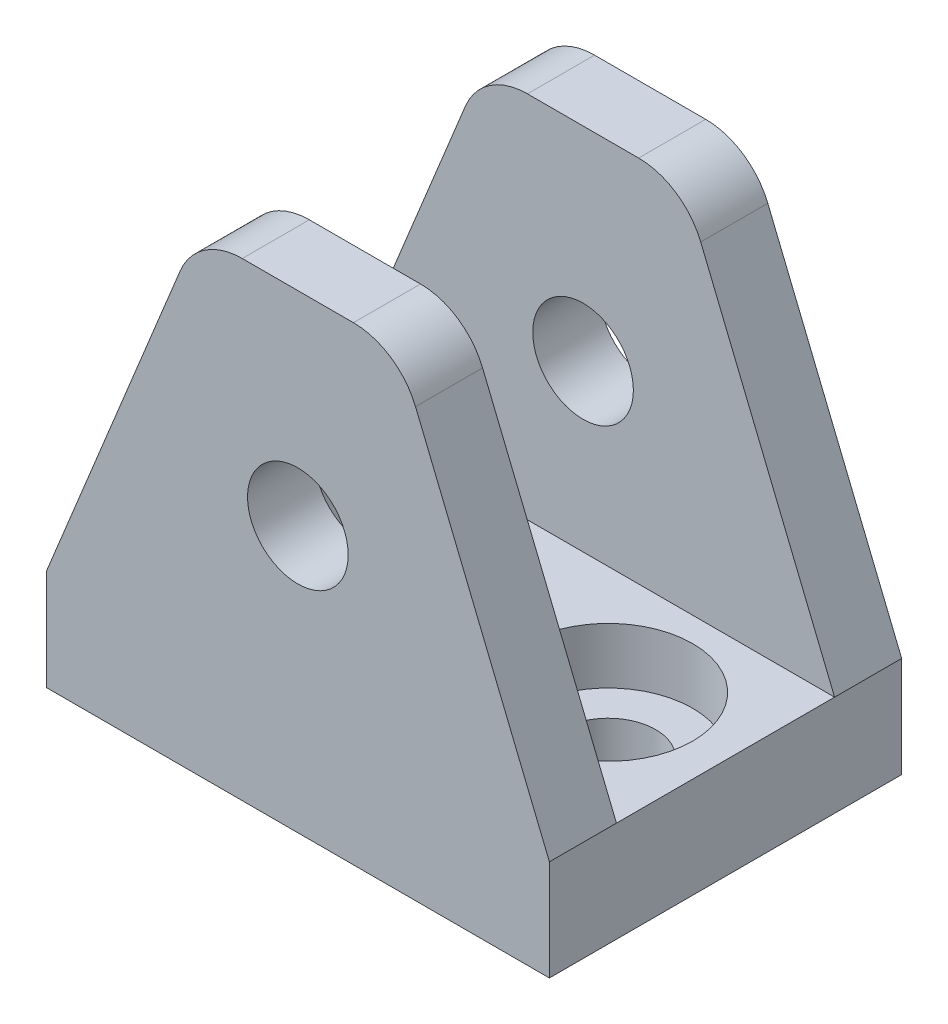
ISO-10303-21;
HEADER;
FILE_DESCRIPTION(('STEP AP214'),'2;1');
FILE_NAME('part.step','',(''),(''),'','','');
FILE_SCHEMA(('AUTOMOTIVE_DESIGN { 1 0 10303 214 1 1 1 1 }'));
ENDSEC;
DATA;
#1=APPLICATION_CONTEXT('core data for automotive mechanical design processes');
#2=APPLICATION_PROTOCOL_DEFINITION('international standard','automotive_design',2000,#1);
#3=PRODUCT_CONTEXT('',#1,'mechanical');
#4=PRODUCT('Part','Part','',(#3));
#5=PRODUCT_RELATED_PRODUCT_CATEGORY('part','',(#4));
#6=PRODUCT_DEFINITION_FORMATION('','',#4);
#7=PRODUCT_DEFINITION_CONTEXT('part definition',#1,'design');
#8=PRODUCT_DEFINITION('design','',#6,#7);
#9=PRODUCT_DEFINITION_SHAPE('','',#8);
#10=(LENGTH_UNIT() NAMED_UNIT(*) SI_UNIT(.MILLI.,.METRE.));
#11=(NAMED_UNIT(*) PLANE_ANGLE_UNIT() SI_UNIT($,.RADIAN.));
#12=(NAMED_UNIT(*) SI_UNIT($,.STERADIAN.) SOLID_ANGLE_UNIT());
#13=UNCERTAINTY_MEASURE_WITH_UNIT(LENGTH_MEASURE(1.E-05),#10,'distance_accuracy_value','');
#14=(GEOMETRIC_REPRESENTATION_CONTEXT(3) GLOBAL_UNCERTAINTY_ASSIGNED_CONTEXT((#13)) GLOBAL_UNIT_ASSIGNED_CONTEXT((#10,
#11,#12)) REPRESENTATION_CONTEXT('',''));
#15=CARTESIAN_POINT('',(0.,0.,0.));
#16=DIRECTION('',(0.,0.,1.));
#17=DIRECTION('',(1.,0.,0.));
#18=AXIS2_PLACEMENT_3D('',#15,#16,#17);
#19=CARTESIAN_POINT('',(0.,44.45,0.));
#20=DIRECTION('',(0.,-1.,0.));
#21=DIRECTION('',(0.,0.,-1.));
#22=AXIS2_PLACEMENT_3D('',#19,#20,#21);
#23=PLANE('',#22);
#24=DIRECTION('',(-1.,0.,0.));
#25=VECTOR('',#24,1.);
#26=CARTESIAN_POINT('',(-23.8125,44.45,-10.3251));
#27=LINE('',#26,#25);
#28=CARTESIAN_POINT('',(5.26191923114274,44.45,-10.3251));
#29=VERTEX_POINT('',#28);
#30=CARTESIAN_POINT('',(-5.26191923114273,44.45,-10.3251));
#31=VERTEX_POINT('',#30);
#32=EDGE_CURVE('E226',#29,#31,#27,.T.);
#33=ORIENTED_EDGE('',*,*,#32,.F.);
#34=DIRECTION('',(0.,0.,-1.));
#35=VECTOR('',#34,1.);
#36=CARTESIAN_POINT('',(5.26191923114274,44.45,0.));
#37=LINE('',#36,#35);
#38=CARTESIAN_POINT('',(5.26191923114274,44.45,-16.6751));
#39=VERTEX_POINT('',#38);
#40=EDGE_CURVE('E219',#29,#39,#37,.T.);
#41=ORIENTED_EDGE('',*,*,#40,.T.);
#42=DIRECTION('',(-1.,0.,0.));
#43=VECTOR('',#42,1.);
#44=CARTESIAN_POINT('',(-23.8125,44.45,-16.6751));
#45=LINE('',#44,#43);
#46=CARTESIAN_POINT('',(-5.26191923114273,44.45,-16.6751));
#47=VERTEX_POINT('',#46);
#48=EDGE_CURVE('E252',#39,#47,#45,.T.);
#49=ORIENTED_EDGE('',*,*,#48,.T.);
#50=DIRECTION('',(0.,0.,-1.));
#51=VECTOR('',#50,1.);
#52=CARTESIAN_POINT('',(-5.26191923114273,44.45,-10.3251));
#53=LINE('',#52,#51);
#54=EDGE_CURVE('E217',#47,#31,#53,.F.);
#55=ORIENTED_EDGE('',*,*,#54,.T.);
#56=EDGE_LOOP('',(#33,#41,#49,#55));
#57=FACE_BOUND('',#56,.T.);
#58=ADVANCED_FACE('F38',(#57),#23,.F.);
#59=CARTESIAN_POINT('',(-23.8125,44.45,-16.6751));
#60=DIRECTION('',(0.,0.,1.));
#61=DIRECTION('',(1.,0.,0.));
#62=AXIS2_PLACEMENT_3D('',#59,#60,#61);
#63=PLANE('',#62);
#64=CARTESIAN_POINT('',(-2.32470293015652E-11,25.1616625766068,-16.6751));
#65=DIRECTION('',(0.,0.,1.));
#66=DIRECTION('',(1.,0.,0.));
#67=AXIS2_PLACEMENT_3D('',#64,#65,#66);
#68=CIRCLE('',#67,4.76249999999999);
#69=CARTESIAN_POINT('',(4.76249999997674,25.1616625766068,-16.6751));
#70=VERTEX_POINT('',#69);
#71=EDGE_CURVE('E42',#70,#70,#68,.T.);
#72=ORIENTED_EDGE('',*,*,#71,.T.);
#73=EDGE_LOOP('',(#72));
#74=FACE_BOUND('',#73,.T.);
#75=ORIENTED_EDGE('',*,*,#48,.F.);
#76=CARTESIAN_POINT('',(5.26191923114274,38.1,-16.6751));
#77=DIRECTION('',(0.,0.,1.));
#78=DIRECTION('',(1.,0.,0.));
#79=AXIS2_PLACEMENT_3D('',#76,#77,#78);
#80=CIRCLE('',#79,6.35);
#81=CARTESIAN_POINT('',(11.1391424030488,40.5043185703252,-16.6751));
#82=VERTEX_POINT('',#81);
#83=EDGE_CURVE('E344',#39,#82,#80,.F.);
#84=ORIENTED_EDGE('',*,*,#83,.T.);
#85=DIRECTION('',(0.378632845720504,-0.925546956205677,0.));
#86=VECTOR('',#85,1.);
#87=CARTESIAN_POINT('',(4.74564159292036,56.1328761061947,-16.6751));
#88=LINE('',#87,#86);
#89=CARTESIAN_POINT('',(23.8125,9.525,-16.6751));
#90=VERTEX_POINT('',#89);
#91=EDGE_CURVE('E228',#82,#90,#88,.T.);
#92=ORIENTED_EDGE('',*,*,#91,.T.);
#93=DIRECTION('',(0.,-1.,0.));
#94=VECTOR('',#93,1.);
#95=CARTESIAN_POINT('',(23.8125,44.45,-16.6751));
#96=LINE('',#95,#94);
#97=CARTESIAN_POINT('',(23.8125,0.,-16.6751));
#98=VERTEX_POINT('',#97);
#99=EDGE_CURVE('E177',#90,#98,#96,.T.);
#100=ORIENTED_EDGE('',*,*,#99,.T.);
#101=DIRECTION('',(-1.,0.,0.));
#102=VECTOR('',#101,1.);
#103=CARTESIAN_POINT('',(-23.8125,0.,-16.6751));
#104=LINE('',#103,#102);
#105=CARTESIAN_POINT('',(-23.8125,0.,-16.6751));
#106=VERTEX_POINT('',#105);
#107=EDGE_CURVE('E260',#98,#106,#104,.T.);
#108=ORIENTED_EDGE('',*,*,#107,.T.);
#109=DIRECTION('',(0.,-1.,0.));
#110=VECTOR('',#109,1.);
#111=CARTESIAN_POINT('',(-23.8125,44.45,-16.6751));
#112=LINE('',#111,#110);
#113=CARTESIAN_POINT('',(-23.8125,9.525,-16.6751));
#114=VERTEX_POINT('',#113);
#115=EDGE_CURVE('E174',#114,#106,#112,.T.);
#116=ORIENTED_EDGE('',*,*,#115,.F.);
#117=DIRECTION('',(-0.378632845720504,-0.925546956205677,0.));
#118=VECTOR('',#117,1.);
#119=CARTESIAN_POINT('',(-11.573296460177,39.4430530973451,-16.6751));
#120=LINE('',#119,#118);
#121=CARTESIAN_POINT('',(-11.1391424030488,40.5043185703252,-16.6751));
#122=VERTEX_POINT('',#121);
#123=EDGE_CURVE('E223',#122,#114,#120,.T.);
#124=ORIENTED_EDGE('',*,*,#123,.F.);
#125=CARTESIAN_POINT('',(-5.26191923114273,38.1,-16.6751));
#126=DIRECTION('',(0.,0.,1.));
#127=DIRECTION('',(1.,0.,0.));
#128=AXIS2_PLACEMENT_3D('',#125,#126,#127);
#129=CIRCLE('',#128,6.35);
#130=EDGE_CURVE('E222',#122,#47,#129,.F.);
#131=ORIENTED_EDGE('',*,*,#130,.T.);
#132=EDGE_LOOP('',(#75,#84,#92,#100,#108,#116,#124,#131));
#133=FACE_BOUND('',#132,.T.);
#134=ADVANCED_FACE('F319',(#74,#133),#63,.F.);
#135=CARTESIAN_POINT('',(-23.8125,44.45,16.6751));
#136=DIRECTION('',(1.,0.,0.));
#137=DIRECTION('',(0.,0.,-1.));
#138=AXIS2_PLACEMENT_3D('',#135,#136,#137);
#139=PLANE('',#138);
#140=DIRECTION('',(0.,0.,-1.));
#141=VECTOR('',#140,1.);
#142=CARTESIAN_POINT('',(-23.8125,9.525,16.6751));
#143=LINE('',#142,#141);
#144=CARTESIAN_POINT('',(-23.8125,9.525,-10.3251));
#145=VERTEX_POINT('',#144);
#146=EDGE_CURVE('E156',#145,#114,#143,.T.);
#147=ORIENTED_EDGE('',*,*,#146,.T.);
#148=ORIENTED_EDGE('',*,*,#115,.T.);
#149=DIRECTION('',(0.,0.,1.));
#150=VECTOR('',#149,1.);
#151=CARTESIAN_POINT('',(-23.8125,0.,16.6751));
#152=LINE('',#151,#150);
#153=CARTESIAN_POINT('',(-23.8125,0.,16.6751));
#154=VERTEX_POINT('',#153);
#155=EDGE_CURVE('E172',#106,#154,#152,.T.);
#156=ORIENTED_EDGE('',*,*,#155,.T.);
#157=DIRECTION('',(0.,-1.,0.));
#158=VECTOR('',#157,1.);
#159=CARTESIAN_POINT('',(-23.8125,44.45,16.6751));
#160=LINE('',#159,#158);
#161=CARTESIAN_POINT('',(-23.8125,9.525,16.6751));
#162=VERTEX_POINT('',#161);
#163=EDGE_CURVE('E162',#162,#154,#160,.T.);
#164=ORIENTED_EDGE('',*,*,#163,.F.);
#165=CARTESIAN_POINT('',(-23.8125,9.525,10.3251));
#166=VERTEX_POINT('',#165);
#167=EDGE_CURVE('E143',#162,#166,#143,.T.);
#168=ORIENTED_EDGE('',*,*,#167,.T.);
#169=DIRECTION('',(0.,0.,1.));
#170=VECTOR('',#169,1.);
#171=CARTESIAN_POINT('',(-23.8125,9.525,10.3251));
#172=LINE('',#171,#170);
#173=EDGE_CURVE('E242',#145,#166,#172,.T.);
#174=ORIENTED_EDGE('',*,*,#173,.F.);
#175=EDGE_LOOP('',(#147,#148,#156,#164,#168,#174));
#176=FACE_BOUND('',#175,.T.);
#177=ADVANCED_FACE('F170',(#176),#139,.F.);
#178=CARTESIAN_POINT('',(-23.8125,44.45,16.6751));
#179=DIRECTION('',(0.,0.,-1.));
#180=DIRECTION('',(-1.,0.,0.));
#181=AXIS2_PLACEMENT_3D('',#178,#179,#180);
#182=PLANE('',#181);
#183=CARTESIAN_POINT('',(-2.32470293015652E-11,25.1616625766068,16.6751));
#184=DIRECTION('',(0.,0.,1.));
#185=DIRECTION('',(1.,0.,0.));
#186=AXIS2_PLACEMENT_3D('',#183,#184,#185);
#187=CIRCLE('',#186,4.76249999999999);
#188=CARTESIAN_POINT('',(4.76249999997674,25.1616625766068,16.6751));
#189=VERTEX_POINT('',#188);
#190=EDGE_CURVE('E312',#189,#189,#187,.T.);
#191=ORIENTED_EDGE('',*,*,#190,.F.);
#192=EDGE_LOOP('',(#191));
#193=FACE_BOUND('',#192,.T.);
#194=DIRECTION('',(-0.378632845720504,0.925546956205677,0.));
#195=VECTOR('',#194,1.);
#196=CARTESIAN_POINT('',(23.7366371681416,9.71044247787611,16.6751));
#197=LINE('',#196,#195);
#198=CARTESIAN_POINT('',(23.8125,9.525,16.6751));
#199=VERTEX_POINT('',#198);
#200=CARTESIAN_POINT('',(11.1391424030488,40.5043185703252,16.6751));
#201=VERTEX_POINT('',#200);
#202=EDGE_CURVE('E194',#199,#201,#197,.T.);
#203=ORIENTED_EDGE('',*,*,#202,.T.);
#204=CARTESIAN_POINT('',(5.26191923114274,38.1,16.6751));
#205=DIRECTION('',(0.,0.,-1.));
#206=DIRECTION('',(-1.,0.,0.));
#207=AXIS2_PLACEMENT_3D('',#204,#205,#206);
#208=CIRCLE('',#207,6.35);
#209=CARTESIAN_POINT('',(5.26191923114274,44.45,16.6751));
#210=VERTEX_POINT('',#209);
#211=EDGE_CURVE('E213',#201,#210,#208,.F.);
#212=ORIENTED_EDGE('',*,*,#211,.T.);
#213=DIRECTION('',(1.,0.,0.));
#214=VECTOR('',#213,1.);
#215=CARTESIAN_POINT('',(-23.8125,44.45,16.6751));
#216=LINE('',#215,#214);
#217=CARTESIAN_POINT('',(-5.26191923114273,44.45,16.6751));
#218=VERTEX_POINT('',#217);
#219=EDGE_CURVE('E179',#218,#210,#216,.T.);
#220=ORIENTED_EDGE('',*,*,#219,.F.);
#221=CARTESIAN_POINT('',(-5.26191923114273,38.1,16.6751));
#222=DIRECTION('',(0.,0.,-1.));
#223=DIRECTION('',(-1.,0.,0.));
#224=AXIS2_PLACEMENT_3D('',#221,#222,#223);
#225=CIRCLE('',#224,6.35);
#226=CARTESIAN_POINT('',(-11.1391424030488,40.5043185703252,16.6751));
#227=VERTEX_POINT('',#226);
#228=EDGE_CURVE('E166',#218,#227,#225,.F.);
#229=ORIENTED_EDGE('',*,*,#228,.T.);
#230=DIRECTION('',(0.378632845720504,0.925546956205677,0.));
#231=VECTOR('',#230,1.);
#232=CARTESIAN_POINT('',(-23.7366371681416,9.71044247787611,16.6751));
#233=LINE('',#232,#231);
#234=EDGE_CURVE('E147',#162,#227,#233,.T.);
#235=ORIENTED_EDGE('',*,*,#234,.F.);
#236=ORIENTED_EDGE('',*,*,#163,.T.);
#237=DIRECTION('',(1.,0.,0.));
#238=VECTOR('',#237,1.);
#239=CARTESIAN_POINT('',(-23.8125,0.,16.6751));
#240=LINE('',#239,#238);
#241=CARTESIAN_POINT('',(23.8125,0.,16.6751));
#242=VERTEX_POINT('',#241);
#243=EDGE_CURVE('E255',#154,#242,#240,.T.);
#244=ORIENTED_EDGE('',*,*,#243,.T.);
#245=DIRECTION('',(0.,-1.,0.));
#246=VECTOR('',#245,1.);
#247=CARTESIAN_POINT('',(23.8125,44.45,16.6751));
#248=LINE('',#247,#246);
#249=EDGE_CURVE('E175',#199,#242,#248,.T.);
#250=ORIENTED_EDGE('',*,*,#249,.F.);
#251=EDGE_LOOP('',(#203,#212,#220,#229,#235,#236,#244,#250));
#252=FACE_BOUND('',#251,.T.);
#253=ADVANCED_FACE('F160',(#193,#252),#182,.F.);
#254=ORIENTED_EDGE('',*,*,#219,.T.);
#255=DIRECTION('',(0.,0.,-1.));
#256=VECTOR('',#255,1.);
#257=CARTESIAN_POINT('',(5.26191923114274,44.45,0.));
#258=LINE('',#257,#256);
#259=CARTESIAN_POINT('',(5.26191923114274,44.45,10.3251));
#260=VERTEX_POINT('',#259);
#261=EDGE_CURVE('E203',#210,#260,#258,.T.);
#262=ORIENTED_EDGE('',*,*,#261,.T.);
#263=DIRECTION('',(1.,0.,0.));
#264=VECTOR('',#263,1.);
#265=CARTESIAN_POINT('',(-23.8125,44.45,10.3251));
#266=LINE('',#265,#264);
#267=CARTESIAN_POINT('',(-5.26191923114273,44.45,10.3251));
#268=VERTEX_POINT('',#267);
#269=EDGE_CURVE('E235',#268,#260,#266,.T.);
#270=ORIENTED_EDGE('',*,*,#269,.F.);
#271=DIRECTION('',(0.,0.,-1.));
#272=VECTOR('',#271,1.);
#273=CARTESIAN_POINT('',(-5.26191923114273,44.45,16.6751));
#274=LINE('',#273,#272);
#275=EDGE_CURVE('E201',#268,#218,#274,.F.);
#276=ORIENTED_EDGE('',*,*,#275,.T.);
#277=EDGE_LOOP('',(#254,#262,#270,#276));
#278=FACE_BOUND('',#277,.T.);
#279=ADVANCED_FACE('F332',(#278),#23,.F.);
#280=CARTESIAN_POINT('',(-23.8125,-51.9092610719899,-10.3251));
#281=DIRECTION('',(0.,0.,-1.));
#282=DIRECTION('',(-1.,0.,0.));
#283=AXIS2_PLACEMENT_3D('',#280,#281,#282);
#284=PLANE('',#283);
#285=CARTESIAN_POINT('',(-2.32470293015652E-11,25.1616625766068,-10.3251));
#286=DIRECTION('',(0.,0.,-1.));
#287=DIRECTION('',(-1.,0.,0.));
#288=AXIS2_PLACEMENT_3D('',#285,#286,#287);
#289=CIRCLE('',#288,4.76249999999999);
#290=CARTESIAN_POINT('',(-4.76250000002324,25.1616625766068,-10.3251));
#291=VERTEX_POINT('',#290);
#292=EDGE_CURVE('E306',#291,#291,#289,.T.);
#293=ORIENTED_EDGE('',*,*,#292,.T.);
#294=EDGE_LOOP('',(#293));
#295=FACE_BOUND('',#294,.T.);
#296=DIRECTION('',(-0.378632845720504,0.925546956205677,0.));
#297=VECTOR('',#296,1.);
#298=CARTESIAN_POINT('',(38.5140198092991,-26.4120484227311,-10.3251));
#299=LINE('',#298,#297);
#300=CARTESIAN_POINT('',(23.8125,9.525,-10.3251));
#301=VERTEX_POINT('',#300);
#302=CARTESIAN_POINT('',(11.1391424030488,40.5043185703252,-10.3251));
#303=VERTEX_POINT('',#302);
#304=EDGE_CURVE('E155',#301,#303,#299,.T.);
#305=ORIENTED_EDGE('',*,*,#304,.T.);
#306=CARTESIAN_POINT('',(5.26191923114274,38.1,-10.3251));
#307=DIRECTION('',(0.,0.,-1.));
#308=DIRECTION('',(-1.,0.,0.));
#309=AXIS2_PLACEMENT_3D('',#306,#307,#308);
#310=CIRCLE('',#309,6.35);
#311=EDGE_CURVE('E47',#303,#29,#310,.F.);
#312=ORIENTED_EDGE('',*,*,#311,.T.);
#313=ORIENTED_EDGE('',*,*,#32,.T.);
#314=CARTESIAN_POINT('',(-5.26191923114273,38.1,-10.3251));
#315=DIRECTION('',(0.,0.,-1.));
#316=DIRECTION('',(-1.,0.,0.));
#317=AXIS2_PLACEMENT_3D('',#314,#315,#316);
#318=CIRCLE('',#317,6.35);
#319=CARTESIAN_POINT('',(-11.1391424030488,40.5043185703252,-10.3251));
#320=VERTEX_POINT('',#319);
#321=EDGE_CURVE('E54',#31,#320,#318,.F.);
#322=ORIENTED_EDGE('',*,*,#321,.T.);
#323=DIRECTION('',(0.378632845720504,0.925546956205677,0.));
#324=VECTOR('',#323,1.);
#325=CARTESIAN_POINT('',(-45.3416746765557,-43.1018714315807,-10.3251));
#326=LINE('',#325,#324);
#327=EDGE_CURVE('E227',#145,#320,#326,.T.);
#328=ORIENTED_EDGE('',*,*,#327,.F.);
#329=DIRECTION('',(-1.,0.,0.));
#330=VECTOR('',#329,1.);
#331=CARTESIAN_POINT('',(-23.8125,9.525,-10.3251));
#332=LINE('',#331,#330);
#333=EDGE_CURVE('E238',#301,#145,#332,.T.);
#334=ORIENTED_EDGE('',*,*,#333,.F.);
#335=EDGE_LOOP('',(#305,#312,#313,#322,#328,#334));
#336=FACE_BOUND('',#335,.T.);
#337=ADVANCED_FACE('F329',(#295,#336),#284,.F.);
#338=CARTESIAN_POINT('',(-23.8125,-51.9092610719899,10.3251));
#339=DIRECTION('',(0.,0.,1.));
#340=DIRECTION('',(1.,0.,0.));
#341=AXIS2_PLACEMENT_3D('',#338,#339,#340);
#342=PLANE('',#341);
#343=CARTESIAN_POINT('',(-2.32470293015652E-11,25.1616625766068,10.3251));
#344=DIRECTION('',(0.,0.,1.));
#345=DIRECTION('',(1.,0.,0.));
#346=AXIS2_PLACEMENT_3D('',#343,#344,#345);
#347=CIRCLE('',#346,4.76249999999999);
#348=CARTESIAN_POINT('',(4.76249999997674,25.1616625766068,10.3251));
#349=VERTEX_POINT('',#348);
#350=EDGE_CURVE('E309',#349,#349,#347,.T.);
#351=ORIENTED_EDGE('',*,*,#350,.T.);
#352=EDGE_LOOP('',(#351));
#353=FACE_BOUND('',#352,.T.);
#354=ORIENTED_EDGE('',*,*,#269,.T.);
#355=CARTESIAN_POINT('',(5.26191923114274,38.1,10.3251));
#356=DIRECTION('',(0.,0.,1.));
#357=DIRECTION('',(1.,0.,0.));
#358=AXIS2_PLACEMENT_3D('',#355,#356,#357);
#359=CIRCLE('',#358,6.35);
#360=CARTESIAN_POINT('',(11.1391424030488,40.5043185703252,10.3251));
#361=VERTEX_POINT('',#360);
#362=EDGE_CURVE('E208',#260,#361,#359,.F.);
#363=ORIENTED_EDGE('',*,*,#362,.T.);
#364=DIRECTION('',(0.378632845720504,-0.925546956205677,0.));
#365=VECTOR('',#364,1.);
#366=CARTESIAN_POINT('',(38.5140198092991,-26.4120484227311,10.3251));
#367=LINE('',#366,#365);
#368=CARTESIAN_POINT('',(23.8125,9.525,10.3251));
#369=VERTEX_POINT('',#368);
#370=EDGE_CURVE('E190',#361,#369,#367,.T.);
#371=ORIENTED_EDGE('',*,*,#370,.T.);
#372=DIRECTION('',(1.,0.,0.));
#373=VECTOR('',#372,1.);
#374=CARTESIAN_POINT('',(-23.8125,9.525,10.3251));
#375=LINE('',#374,#373);
#376=EDGE_CURVE('E247',#166,#369,#375,.T.);
#377=ORIENTED_EDGE('',*,*,#376,.F.);
#378=DIRECTION('',(-0.378632845720504,-0.925546956205677,0.));
#379=VECTOR('',#378,1.);
#380=CARTESIAN_POINT('',(-45.3416746765557,-43.1018714315807,10.3251));
#381=LINE('',#380,#379);
#382=CARTESIAN_POINT('',(-11.1391424030488,40.5043185703252,10.3251));
#383=VERTEX_POINT('',#382);
#384=EDGE_CURVE('E150',#383,#166,#381,.T.);
#385=ORIENTED_EDGE('',*,*,#384,.F.);
#386=CARTESIAN_POINT('',(-5.26191923114273,38.1,10.3251));
#387=DIRECTION('',(0.,0.,1.));
#388=DIRECTION('',(1.,0.,0.));
#389=AXIS2_PLACEMENT_3D('',#386,#387,#388);
#390=CIRCLE('',#389,6.35);
#391=EDGE_CURVE('E206',#383,#268,#390,.F.);
#392=ORIENTED_EDGE('',*,*,#391,.T.);
#393=EDGE_LOOP('',(#354,#363,#371,#377,#385,#392));
#394=FACE_BOUND('',#393,.T.);
#395=ADVANCED_FACE('F331',(#353,#394),#342,.F.);
#396=CARTESIAN_POINT('',(23.8125,44.45,16.6751));
#397=DIRECTION('',(-1.,0.,0.));
#398=DIRECTION('',(0.,0.,1.));
#399=AXIS2_PLACEMENT_3D('',#396,#397,#398);
#400=PLANE('',#399);
#401=ORIENTED_EDGE('',*,*,#99,.F.);
#402=DIRECTION('',(0.,0.,-1.));
#403=VECTOR('',#402,1.);
#404=CARTESIAN_POINT('',(23.8125,9.525,16.6751));
#405=LINE('',#404,#403);
#406=EDGE_CURVE('E277',#301,#90,#405,.T.);
#407=ORIENTED_EDGE('',*,*,#406,.F.);
#408=DIRECTION('',(0.,0.,-1.));
#409=VECTOR('',#408,1.);
#410=CARTESIAN_POINT('',(23.8125,9.525,10.3251));
#411=LINE('',#410,#409);
#412=EDGE_CURVE('E243',#369,#301,#411,.T.);
#413=ORIENTED_EDGE('',*,*,#412,.F.);
#414=EDGE_CURVE('E167',#199,#369,#405,.T.);
#415=ORIENTED_EDGE('',*,*,#414,.F.);
#416=ORIENTED_EDGE('',*,*,#249,.T.);
#417=DIRECTION('',(0.,0.,-1.));
#418=VECTOR('',#417,1.);
#419=CARTESIAN_POINT('',(23.8125,0.,16.6751));
#420=LINE('',#419,#418);
#421=EDGE_CURVE('E246',#242,#98,#420,.T.);
#422=ORIENTED_EDGE('',*,*,#421,.T.);
#423=EDGE_LOOP('',(#401,#407,#413,#415,#416,#422));
#424=FACE_BOUND('',#423,.T.);
#425=ADVANCED_FACE('F270',(#424),#400,.F.);
#426=CARTESIAN_POINT('',(0.,0.,0.));
#427=DIRECTION('',(0.,-1.,0.));
#428=DIRECTION('',(0.,0.,-1.));
#429=AXIS2_PLACEMENT_3D('',#426,#427,#428);
#430=PLANE('',#429);
#431=CARTESIAN_POINT('',(-12.7,0.,0.));
#432=DIRECTION('',(0.,-1.,0.));
#433=DIRECTION('',(0.,0.,-1.));
#434=AXIS2_PLACEMENT_3D('',#431,#432,#433);
#435=CIRCLE('',#434,4.5);
#436=CARTESIAN_POINT('',(-12.7,0.,-4.5));
#437=VERTEX_POINT('',#436);
#438=EDGE_CURVE('E196',#437,#437,#435,.T.);
#439=ORIENTED_EDGE('',*,*,#438,.F.);
#440=EDGE_LOOP('',(#439));
#441=FACE_BOUND('',#440,.T.);
#442=CARTESIAN_POINT('',(12.7,0.,0.));
#443=DIRECTION('',(0.,-1.,0.));
#444=DIRECTION('',(0.,0.,-1.));
#445=AXIS2_PLACEMENT_3D('',#442,#443,#444);
#446=CIRCLE('',#445,4.5);
#447=CARTESIAN_POINT('',(12.7,0.,-4.5));
#448=VERTEX_POINT('',#447);
#449=EDGE_CURVE('E191',#448,#448,#446,.T.);
#450=ORIENTED_EDGE('',*,*,#449,.F.);
#451=EDGE_LOOP('',(#450));
#452=FACE_BOUND('',#451,.T.);
#453=ORIENTED_EDGE('',*,*,#421,.F.);
#454=ORIENTED_EDGE('',*,*,#243,.F.);
#455=ORIENTED_EDGE('',*,*,#155,.F.);
#456=ORIENTED_EDGE('',*,*,#107,.F.);
#457=EDGE_LOOP('',(#453,#454,#455,#456));
#458=FACE_BOUND('',#457,.T.);
#459=ADVANCED_FACE('F267',(#441,#452,#458),#430,.T.);
#460=CARTESIAN_POINT('',(0.,9.525,0.));
#461=DIRECTION('',(0.,-1.,0.));
#462=DIRECTION('',(0.,0.,-1.));
#463=AXIS2_PLACEMENT_3D('',#460,#461,#462);
#464=PLANE('',#463);
#465=CARTESIAN_POINT('',(-12.7,9.525,0.));
#466=DIRECTION('',(0.,1.,0.));
#467=DIRECTION('',(0.,0.,1.));
#468=AXIS2_PLACEMENT_3D('',#465,#466,#467);
#469=CIRCLE('',#468,8.);
#470=CARTESIAN_POINT('',(-12.7,9.525,8.));
#471=VERTEX_POINT('',#470);
#472=EDGE_CURVE('E303',#471,#471,#469,.T.);
#473=ORIENTED_EDGE('',*,*,#472,.F.);
#474=EDGE_LOOP('',(#473));
#475=FACE_BOUND('',#474,.T.);
#476=CARTESIAN_POINT('',(12.7,9.525,0.));
#477=DIRECTION('',(0.,1.,0.));
#478=DIRECTION('',(0.,0.,1.));
#479=AXIS2_PLACEMENT_3D('',#476,#477,#478);
#480=CIRCLE('',#479,8.);
#481=CARTESIAN_POINT('',(12.7,9.525,8.));
#482=VERTEX_POINT('',#481);
#483=EDGE_CURVE('E199',#482,#482,#480,.T.);
#484=ORIENTED_EDGE('',*,*,#483,.F.);
#485=EDGE_LOOP('',(#484));
#486=FACE_BOUND('',#485,.T.);
#487=ORIENTED_EDGE('',*,*,#412,.T.);
#488=ORIENTED_EDGE('',*,*,#333,.T.);
#489=ORIENTED_EDGE('',*,*,#173,.T.);
#490=ORIENTED_EDGE('',*,*,#376,.T.);
#491=EDGE_LOOP('',(#487,#488,#489,#490));
#492=FACE_BOUND('',#491,.T.);
#493=ADVANCED_FACE('F366',(#475,#486,#492),#464,.F.);
#494=CARTESIAN_POINT('',(23.7366371681416,9.71044247787611,16.6751));
#495=DIRECTION('',(-0.925546956205677,-0.378632845720504,0.));
#496=DIRECTION('',(0.378632845720504,-0.925546956205677,0.));
#497=AXIS2_PLACEMENT_3D('',#494,#495,#496);
#498=PLANE('',#497);
#499=ORIENTED_EDGE('',*,*,#370,.F.);
#500=DIRECTION('',(0.,0.,-1.));
#501=VECTOR('',#500,1.);
#502=CARTESIAN_POINT('',(11.1391424030488,40.5043185703252,16.6751));
#503=LINE('',#502,#501);
#504=EDGE_CURVE('E210',#361,#201,#503,.F.);
#505=ORIENTED_EDGE('',*,*,#504,.T.);
#506=ORIENTED_EDGE('',*,*,#202,.F.);
#507=ORIENTED_EDGE('',*,*,#414,.T.);
#508=EDGE_LOOP('',(#499,#505,#506,#507));
#509=FACE_BOUND('',#508,.T.);
#510=ADVANCED_FACE('F357',(#509),#498,.F.);
#511=CARTESIAN_POINT('',(-23.7366371681416,9.71044247787611,16.6751));
#512=DIRECTION('',(-0.925546956205677,0.378632845720504,0.));
#513=DIRECTION('',(-0.378632845720504,-0.925546956205677,0.));
#514=AXIS2_PLACEMENT_3D('',#511,#512,#513);
#515=PLANE('',#514);
#516=ORIENTED_EDGE('',*,*,#234,.T.);
#517=DIRECTION('',(0.,0.,-1.));
#518=VECTOR('',#517,1.);
#519=CARTESIAN_POINT('',(-11.1391424030488,40.5043185703252,10.3251));
#520=LINE('',#519,#518);
#521=EDGE_CURVE('E215',#227,#383,#520,.T.);
#522=ORIENTED_EDGE('',*,*,#521,.T.);
#523=ORIENTED_EDGE('',*,*,#384,.T.);
#524=ORIENTED_EDGE('',*,*,#167,.F.);
#525=EDGE_LOOP('',(#516,#522,#523,#524));
#526=FACE_BOUND('',#525,.T.);
#527=ADVANCED_FACE('F145',(#526),#515,.T.);
#528=ORIENTED_EDGE('',*,*,#91,.F.);
#529=DIRECTION('',(0.,0.,-1.));
#530=VECTOR('',#529,1.);
#531=CARTESIAN_POINT('',(11.1391424030488,40.5043185703252,16.6751));
#532=LINE('',#531,#530);
#533=EDGE_CURVE('E62',#82,#303,#532,.F.);
#534=ORIENTED_EDGE('',*,*,#533,.T.);
#535=ORIENTED_EDGE('',*,*,#304,.F.);
#536=ORIENTED_EDGE('',*,*,#406,.T.);
#537=EDGE_LOOP('',(#528,#534,#535,#536));
#538=FACE_BOUND('',#537,.T.);
#539=ADVANCED_FACE('F354',(#538),#498,.F.);
#540=ORIENTED_EDGE('',*,*,#327,.T.);
#541=DIRECTION('',(0.,0.,-1.));
#542=VECTOR('',#541,1.);
#543=CARTESIAN_POINT('',(-11.1391424030488,40.5043185703252,-16.6751));
#544=LINE('',#543,#542);
#545=EDGE_CURVE('E12',#320,#122,#544,.T.);
#546=ORIENTED_EDGE('',*,*,#545,.T.);
#547=ORIENTED_EDGE('',*,*,#123,.T.);
#548=ORIENTED_EDGE('',*,*,#146,.F.);
#549=EDGE_LOOP('',(#540,#546,#547,#548));
#550=FACE_BOUND('',#549,.T.);
#551=ADVANCED_FACE('F353',(#550),#515,.T.);
#552=CARTESIAN_POINT('',(12.7,9.525,0.));
#553=DIRECTION('',(0.,1.,0.));
#554=DIRECTION('',(0.,0.,1.));
#555=AXIS2_PLACEMENT_3D('',#552,#553,#554);
#556=CYLINDRICAL_SURFACE('',#555,4.5);
#557=ORIENTED_EDGE('',*,*,#449,.T.);
#558=EDGE_LOOP('',(#557));
#559=FACE_BOUND('',#558,.T.);
#560=CARTESIAN_POINT('',(12.7,4.225,0.));
#561=DIRECTION('',(0.,1.,0.));
#562=DIRECTION('',(0.,0.,1.));
#563=AXIS2_PLACEMENT_3D('',#560,#561,#562);
#564=CIRCLE('',#563,4.5);
#565=CARTESIAN_POINT('',(12.7,4.225,4.5));
#566=VERTEX_POINT('',#565);
#567=EDGE_CURVE('E195',#566,#566,#564,.T.);
#568=ORIENTED_EDGE('',*,*,#567,.T.);
#569=EDGE_LOOP('',(#568));
#570=FACE_BOUND('',#569,.T.);
#571=ADVANCED_FACE('F362',(#559,#570),#556,.F.);
#572=CARTESIAN_POINT('',(17.2,4.225,0.));
#573=DIRECTION('',(0.,-1.,0.));
#574=DIRECTION('',(0.,0.,-1.));
#575=AXIS2_PLACEMENT_3D('',#572,#573,#574);
#576=PLANE('',#575);
#577=ORIENTED_EDGE('',*,*,#567,.F.);
#578=EDGE_LOOP('',(#577));
#579=FACE_BOUND('',#578,.T.);
#580=CARTESIAN_POINT('',(12.7,4.225,0.));
#581=DIRECTION('',(0.,1.,0.));
#582=DIRECTION('',(0.,0.,1.));
#583=AXIS2_PLACEMENT_3D('',#580,#581,#582);
#584=CIRCLE('',#583,8.);
#585=CARTESIAN_POINT('',(12.7,4.225,8.));
#586=VERTEX_POINT('',#585);
#587=EDGE_CURVE('E293',#586,#586,#584,.T.);
#588=ORIENTED_EDGE('',*,*,#587,.T.);
#589=EDGE_LOOP('',(#588));
#590=FACE_BOUND('',#589,.T.);
#591=ADVANCED_FACE('F428',(#579,#590),#576,.F.);
#592=CARTESIAN_POINT('',(12.7,9.525,0.));
#593=DIRECTION('',(0.,1.,0.));
#594=DIRECTION('',(0.,0.,1.));
#595=AXIS2_PLACEMENT_3D('',#592,#593,#594);
#596=CYLINDRICAL_SURFACE('',#595,8.);
#597=ORIENTED_EDGE('',*,*,#587,.F.);
#598=EDGE_LOOP('',(#597));
#599=FACE_BOUND('',#598,.T.);
#600=ORIENTED_EDGE('',*,*,#483,.T.);
#601=EDGE_LOOP('',(#600));
#602=FACE_BOUND('',#601,.T.);
#603=ADVANCED_FACE('F424',(#599,#602),#596,.F.);
#604=CARTESIAN_POINT('',(-12.7,9.525,0.));
#605=DIRECTION('',(0.,1.,0.));
#606=DIRECTION('',(0.,0.,1.));
#607=AXIS2_PLACEMENT_3D('',#604,#605,#606);
#608=CYLINDRICAL_SURFACE('',#607,4.5);
#609=ORIENTED_EDGE('',*,*,#438,.T.);
#610=EDGE_LOOP('',(#609));
#611=FACE_BOUND('',#610,.T.);
#612=CARTESIAN_POINT('',(-12.7,4.225,0.));
#613=DIRECTION('',(0.,1.,0.));
#614=DIRECTION('',(0.,0.,1.));
#615=AXIS2_PLACEMENT_3D('',#612,#613,#614);
#616=CIRCLE('',#615,4.5);
#617=CARTESIAN_POINT('',(-12.7,4.225,4.5));
#618=VERTEX_POINT('',#617);
#619=EDGE_CURVE('E200',#618,#618,#616,.T.);
#620=ORIENTED_EDGE('',*,*,#619,.T.);
#621=EDGE_LOOP('',(#620));
#622=FACE_BOUND('',#621,.T.);
#623=ADVANCED_FACE('F420',(#611,#622),#608,.F.);
#624=CARTESIAN_POINT('',(-8.2,4.225,0.));
#625=DIRECTION('',(0.,-1.,0.));
#626=DIRECTION('',(0.,0.,-1.));
#627=AXIS2_PLACEMENT_3D('',#624,#625,#626);
#628=PLANE('',#627);
#629=ORIENTED_EDGE('',*,*,#619,.F.);
#630=EDGE_LOOP('',(#629));
#631=FACE_BOUND('',#630,.T.);
#632=CARTESIAN_POINT('',(-12.7,4.225,0.));
#633=DIRECTION('',(0.,1.,0.));
#634=DIRECTION('',(0.,0.,1.));
#635=AXIS2_PLACEMENT_3D('',#632,#633,#634);
#636=CIRCLE('',#635,8.);
#637=CARTESIAN_POINT('',(-12.7,4.225,8.));
#638=VERTEX_POINT('',#637);
#639=EDGE_CURVE('E300',#638,#638,#636,.T.);
#640=ORIENTED_EDGE('',*,*,#639,.T.);
#641=EDGE_LOOP('',(#640));
#642=FACE_BOUND('',#641,.T.);
#643=ADVANCED_FACE('F416',(#631,#642),#628,.F.);
#644=CARTESIAN_POINT('',(-12.7,9.525,0.));
#645=DIRECTION('',(0.,1.,0.));
#646=DIRECTION('',(0.,0.,1.));
#647=AXIS2_PLACEMENT_3D('',#644,#645,#646);
#648=CYLINDRICAL_SURFACE('',#647,8.);
#649=ORIENTED_EDGE('',*,*,#639,.F.);
#650=EDGE_LOOP('',(#649));
#651=FACE_BOUND('',#650,.T.);
#652=ORIENTED_EDGE('',*,*,#472,.T.);
#653=EDGE_LOOP('',(#652));
#654=FACE_BOUND('',#653,.T.);
#655=ADVANCED_FACE('F413',(#651,#654),#648,.F.);
#656=CARTESIAN_POINT('',(5.26191923114274,38.1,0.));
#657=DIRECTION('',(0.,0.,-1.));
#658=DIRECTION('',(-1.,0.,0.));
#659=AXIS2_PLACEMENT_3D('',#656,#657,#658);
#660=CYLINDRICAL_SURFACE('',#659,6.35);
#661=ORIENTED_EDGE('',*,*,#211,.F.);
#662=ORIENTED_EDGE('',*,*,#504,.F.);
#663=ORIENTED_EDGE('',*,*,#362,.F.);
#664=ORIENTED_EDGE('',*,*,#261,.F.);
#665=EDGE_LOOP('',(#661,#662,#663,#664));
#666=FACE_BOUND('',#665,.T.);
#667=ADVANCED_FACE('F387',(#666),#660,.T.);
#668=CARTESIAN_POINT('',(-5.26191923114273,38.1,16.6751));
#669=DIRECTION('',(0.,0.,1.));
#670=DIRECTION('',(1.,0.,0.));
#671=AXIS2_PLACEMENT_3D('',#668,#669,#670);
#672=CYLINDRICAL_SURFACE('',#671,6.35);
#673=ORIENTED_EDGE('',*,*,#228,.F.);
#674=ORIENTED_EDGE('',*,*,#275,.F.);
#675=ORIENTED_EDGE('',*,*,#391,.F.);
#676=ORIENTED_EDGE('',*,*,#521,.F.);
#677=EDGE_LOOP('',(#673,#674,#675,#676));
#678=FACE_BOUND('',#677,.T.);
#679=ADVANCED_FACE('F391',(#678),#672,.T.);
#680=CARTESIAN_POINT('',(5.26191923114274,38.1,0.));
#681=DIRECTION('',(0.,0.,-1.));
#682=DIRECTION('',(-1.,0.,0.));
#683=AXIS2_PLACEMENT_3D('',#680,#681,#682);
#684=CYLINDRICAL_SURFACE('',#683,6.35);
#685=ORIENTED_EDGE('',*,*,#311,.F.);
#686=ORIENTED_EDGE('',*,*,#533,.F.);
#687=ORIENTED_EDGE('',*,*,#83,.F.);
#688=ORIENTED_EDGE('',*,*,#40,.F.);
#689=EDGE_LOOP('',(#685,#686,#687,#688));
#690=FACE_BOUND('',#689,.T.);
#691=ADVANCED_FACE('F339',(#690),#684,.T.);
#692=CARTESIAN_POINT('',(-5.26191923114273,38.1,16.6751));
#693=DIRECTION('',(0.,0.,1.));
#694=DIRECTION('',(1.,0.,0.));
#695=AXIS2_PLACEMENT_3D('',#692,#693,#694);
#696=CYLINDRICAL_SURFACE('',#695,6.35);
#697=ORIENTED_EDGE('',*,*,#321,.F.);
#698=ORIENTED_EDGE('',*,*,#54,.F.);
#699=ORIENTED_EDGE('',*,*,#130,.F.);
#700=ORIENTED_EDGE('',*,*,#545,.F.);
#701=EDGE_LOOP('',(#697,#698,#699,#700));
#702=FACE_BOUND('',#701,.T.);
#703=ADVANCED_FACE('F40',(#702),#696,.T.);
#704=CARTESIAN_POINT('',(-2.32470293015652E-11,25.1616625766068,16.6751));
#705=DIRECTION('',(0.,0.,1.));
#706=DIRECTION('',(1.,0.,0.));
#707=AXIS2_PLACEMENT_3D('',#704,#705,#706);
#708=CYLINDRICAL_SURFACE('',#707,4.76249999999999);
#709=ORIENTED_EDGE('',*,*,#71,.F.);
#710=EDGE_LOOP('',(#709));
#711=FACE_BOUND('',#710,.T.);
#712=ORIENTED_EDGE('',*,*,#292,.F.);
#713=EDGE_LOOP('',(#712));
#714=FACE_BOUND('',#713,.T.);
#715=ADVANCED_FACE('F322',(#711,#714),#708,.F.);
#716=ORIENTED_EDGE('',*,*,#190,.T.);
#717=EDGE_LOOP('',(#716));
#718=FACE_BOUND('',#717,.T.);
#719=ORIENTED_EDGE('',*,*,#350,.F.);
#720=EDGE_LOOP('',(#719));
#721=FACE_BOUND('',#720,.T.);
#722=ADVANCED_FACE('F325',(#718,#721),#708,.F.);
#723=CLOSED_SHELL('',(#58,#134,#177,#253,#279,#337,#395,#425,#459,#493,#510,#527,#539,#551,#571,
#591,#603,#623,#643,#655,#667,#679,#691,#703,#715,#722));
#724=MANIFOLD_SOLID_BREP('B2',#723);
#725=ADVANCED_BREP_SHAPE_REPRESENTATION('',(#18,#724),#14);
#726=SHAPE_DEFINITION_REPRESENTATION(#9,#725);
ENDSEC;
END-ISO-10303-21;
